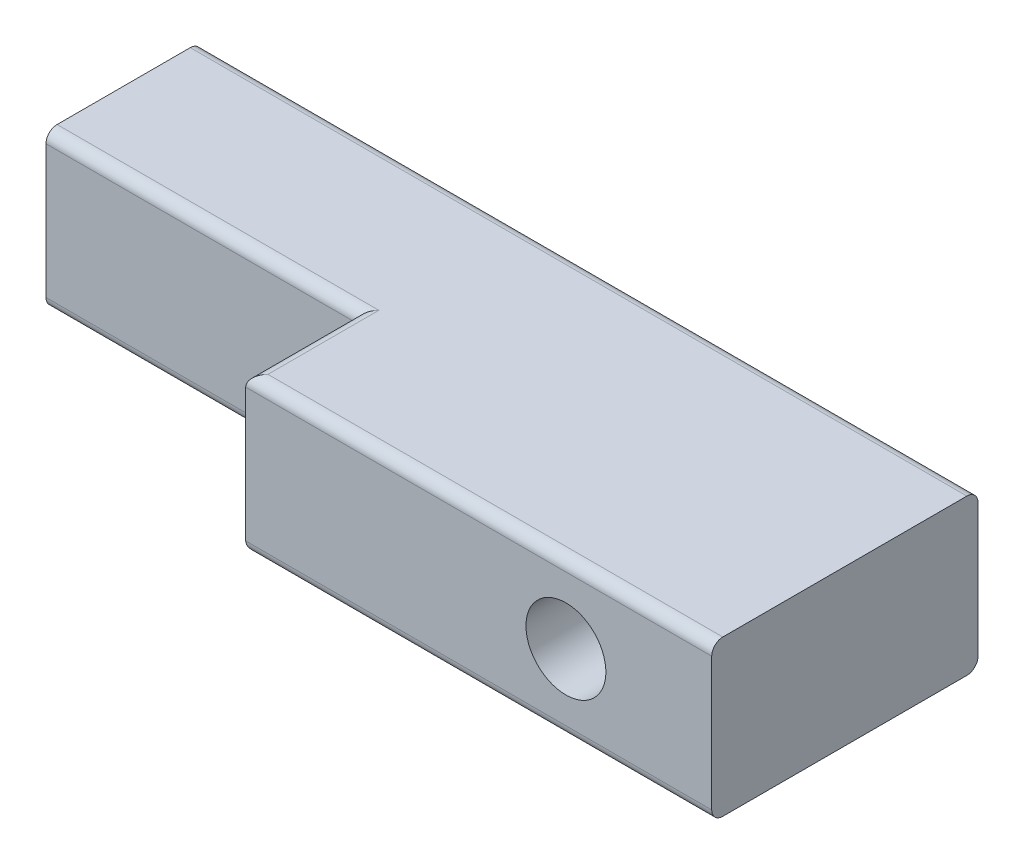
ISO-10303-21;
HEADER;
FILE_DESCRIPTION(('STEP AP214'),'2;1');
FILE_NAME('part.step','',(''),(''),'','','');
FILE_SCHEMA(('AUTOMOTIVE_DESIGN { 1 0 10303 214 1 1 1 1 }'));
ENDSEC;
DATA;
#1=APPLICATION_CONTEXT('core data for automotive mechanical design processes');
#2=APPLICATION_PROTOCOL_DEFINITION('international standard','automotive_design',2000,#1);
#3=PRODUCT_CONTEXT('',#1,'mechanical');
#4=PRODUCT('Part','Part','',(#3));
#5=PRODUCT_RELATED_PRODUCT_CATEGORY('part','',(#4));
#6=PRODUCT_DEFINITION_FORMATION('','',#4);
#7=PRODUCT_DEFINITION_CONTEXT('part definition',#1,'design');
#8=PRODUCT_DEFINITION('design','',#6,#7);
#9=PRODUCT_DEFINITION_SHAPE('','',#8);
#10=(LENGTH_UNIT() NAMED_UNIT(*) SI_UNIT(.MILLI.,.METRE.));
#11=(NAMED_UNIT(*) PLANE_ANGLE_UNIT() SI_UNIT($,.RADIAN.));
#12=(NAMED_UNIT(*) SI_UNIT($,.STERADIAN.) SOLID_ANGLE_UNIT());
#13=UNCERTAINTY_MEASURE_WITH_UNIT(LENGTH_MEASURE(1.E-05),#10,'distance_accuracy_value','');
#14=(GEOMETRIC_REPRESENTATION_CONTEXT(3) GLOBAL_UNCERTAINTY_ASSIGNED_CONTEXT((#13)) GLOBAL_UNIT_ASSIGNED_CONTEXT((#10,
#11,#12)) REPRESENTATION_CONTEXT('',''));
#15=CARTESIAN_POINT('',(0.,0.,0.));
#16=DIRECTION('',(0.,0.,1.));
#17=DIRECTION('',(1.,0.,0.));
#18=AXIS2_PLACEMENT_3D('',#15,#16,#17);
#19=CARTESIAN_POINT('',(0.,0.,7.));
#20=DIRECTION('',(0.,0.,-1.));
#21=DIRECTION('',(-1.,0.,0.));
#22=AXIS2_PLACEMENT_3D('',#19,#20,#21);
#23=PLANE('',#22);
#24=DIRECTION('',(0.,-1.,0.));
#25=VECTOR('',#24,1.);
#26=CARTESIAN_POINT('',(-17.5,-3.5,7.));
#27=LINE('',#26,#25);
#28=CARTESIAN_POINT('',(-17.5,3.,7.));
#29=VERTEX_POINT('',#28);
#30=CARTESIAN_POINT('',(-17.5,-3.,7.));
#31=VERTEX_POINT('',#30);
#32=EDGE_CURVE('E169',#29,#31,#27,.T.);
#33=ORIENTED_EDGE('',*,*,#32,.T.);
#34=DIRECTION('',(1.,0.,0.));
#35=VECTOR('',#34,1.);
#36=CARTESIAN_POINT('',(0.,-3.,7.));
#37=LINE('',#36,#35);
#38=CARTESIAN_POINT('',(-3.5,-3.,7.));
#39=VERTEX_POINT('',#38);
#40=EDGE_CURVE('E146',#31,#39,#37,.T.);
#41=ORIENTED_EDGE('',*,*,#40,.T.);
#42=DIRECTION('',(0.,-1.,0.));
#43=VECTOR('',#42,1.);
#44=CARTESIAN_POINT('',(-3.5,3.5,7.));
#45=LINE('',#44,#43);
#46=CARTESIAN_POINT('',(-3.5,3.,7.));
#47=VERTEX_POINT('',#46);
#48=EDGE_CURVE('E153',#47,#39,#45,.T.);
#49=ORIENTED_EDGE('',*,*,#48,.F.);
#50=DIRECTION('',(-1.,0.,0.));
#51=VECTOR('',#50,1.);
#52=CARTESIAN_POINT('',(0.,3.,7.));
#53=LINE('',#52,#51);
#54=EDGE_CURVE('E139',#47,#29,#53,.T.);
#55=ORIENTED_EDGE('',*,*,#54,.T.);
#56=EDGE_LOOP('',(#33,#41,#49,#55));
#57=FACE_BOUND('',#56,.T.);
#58=ADVANCED_FACE('F36',(#57),#23,.F.);
#59=CARTESIAN_POINT('',(17.5,-3.5,7.));
#60=DIRECTION('',(-1.,0.,0.));
#61=DIRECTION('',(0.,0.,1.));
#62=AXIS2_PLACEMENT_3D('',#59,#60,#61);
#63=PLANE('',#62);
#64=DIRECTION('',(0.,1.,0.));
#65=VECTOR('',#64,1.);
#66=CARTESIAN_POINT('',(17.5,3.5,12.));
#67=LINE('',#66,#65);
#68=CARTESIAN_POINT('',(17.5,-3.,12.));
#69=VERTEX_POINT('',#68);
#70=CARTESIAN_POINT('',(17.5,3.,12.));
#71=VERTEX_POINT('',#70);
#72=EDGE_CURVE('E162',#69,#71,#67,.T.);
#73=ORIENTED_EDGE('',*,*,#72,.F.);
#74=CARTESIAN_POINT('',(17.5,-3.,11.5));
#75=DIRECTION('',(-1.,0.,0.));
#76=DIRECTION('',(0.,0.,1.));
#77=AXIS2_PLACEMENT_3D('',#74,#75,#76);
#78=CIRCLE('',#77,0.5);
#79=CARTESIAN_POINT('',(17.5,-3.5,11.5));
#80=VERTEX_POINT('',#79);
#81=EDGE_CURVE('E221',#69,#80,#78,.F.);
#82=ORIENTED_EDGE('',*,*,#81,.T.);
#83=DIRECTION('',(0.,0.,-1.));
#84=VECTOR('',#83,1.);
#85=CARTESIAN_POINT('',(17.5,-3.5,7.));
#86=LINE('',#85,#84);
#87=CARTESIAN_POINT('',(17.5,-3.5,0.5));
#88=VERTEX_POINT('',#87);
#89=EDGE_CURVE('E171',#80,#88,#86,.T.);
#90=ORIENTED_EDGE('',*,*,#89,.T.);
#91=CARTESIAN_POINT('',(17.5,-3.,0.5));
#92=DIRECTION('',(-1.,0.,0.));
#93=DIRECTION('',(0.,0.,1.));
#94=AXIS2_PLACEMENT_3D('',#91,#92,#93);
#95=CIRCLE('',#94,0.5);
#96=CARTESIAN_POINT('',(17.5,-3.,0.));
#97=VERTEX_POINT('',#96);
#98=EDGE_CURVE('E59',#88,#97,#95,.F.);
#99=ORIENTED_EDGE('',*,*,#98,.T.);
#100=DIRECTION('',(0.,1.,0.));
#101=VECTOR('',#100,1.);
#102=CARTESIAN_POINT('',(17.5,-3.5,0.));
#103=LINE('',#102,#101);
#104=CARTESIAN_POINT('',(17.5,3.,0.));
#105=VERTEX_POINT('',#104);
#106=EDGE_CURVE('E173',#97,#105,#103,.T.);
#107=ORIENTED_EDGE('',*,*,#106,.T.);
#108=CARTESIAN_POINT('',(17.5,3.,0.5));
#109=DIRECTION('',(-1.,0.,0.));
#110=DIRECTION('',(0.,0.,1.));
#111=AXIS2_PLACEMENT_3D('',#108,#109,#110);
#112=CIRCLE('',#111,0.5);
#113=CARTESIAN_POINT('',(17.5,3.5,0.5));
#114=VERTEX_POINT('',#113);
#115=EDGE_CURVE('E216',#105,#114,#112,.F.);
#116=ORIENTED_EDGE('',*,*,#115,.T.);
#117=DIRECTION('',(0.,0.,-1.));
#118=VECTOR('',#117,1.);
#119=CARTESIAN_POINT('',(17.5,3.5,7.));
#120=LINE('',#119,#118);
#121=CARTESIAN_POINT('',(17.5,3.5,11.5));
#122=VERTEX_POINT('',#121);
#123=EDGE_CURVE('E184',#122,#114,#120,.T.);
#124=ORIENTED_EDGE('',*,*,#123,.F.);
#125=CARTESIAN_POINT('',(17.5,3.,11.5));
#126=DIRECTION('',(-1.,0.,0.));
#127=DIRECTION('',(0.,0.,1.));
#128=AXIS2_PLACEMENT_3D('',#125,#126,#127);
#129=CIRCLE('',#128,0.5);
#130=EDGE_CURVE('E219',#122,#71,#129,.F.);
#131=ORIENTED_EDGE('',*,*,#130,.T.);
#132=EDGE_LOOP('',(#73,#82,#90,#99,#107,#116,#124,#131));
#133=FACE_BOUND('',#132,.T.);
#134=ADVANCED_FACE('F266',(#133),#63,.F.);
#135=CARTESIAN_POINT('',(-17.5,3.5,7.));
#136=DIRECTION('',(0.,-1.,0.));
#137=DIRECTION('',(0.,0.,-1.));
#138=AXIS2_PLACEMENT_3D('',#135,#136,#137);
#139=PLANE('',#138);
#140=DIRECTION('',(0.,0.,-1.));
#141=VECTOR('',#140,1.);
#142=CARTESIAN_POINT('',(-17.5,3.5,7.));
#143=LINE('',#142,#141);
#144=CARTESIAN_POINT('',(-17.5,3.5,6.5));
#145=VERTEX_POINT('',#144);
#146=CARTESIAN_POINT('',(-17.5,3.5,0.5));
#147=VERTEX_POINT('',#146);
#148=EDGE_CURVE('E181',#145,#147,#143,.T.);
#149=ORIENTED_EDGE('',*,*,#148,.F.);
#150=DIRECTION('',(-1.,0.,0.));
#151=VECTOR('',#150,1.);
#152=CARTESIAN_POINT('',(-17.5,3.5,6.5));
#153=LINE('',#152,#151);
#154=CARTESIAN_POINT('',(-3.,3.5,6.5));
#155=VERTEX_POINT('',#154);
#156=EDGE_CURVE('E193',#145,#155,#153,.F.);
#157=ORIENTED_EDGE('',*,*,#156,.T.);
#158=DIRECTION('',(0.,0.,-1.));
#159=VECTOR('',#158,1.);
#160=CARTESIAN_POINT('',(-3.,3.5,7.));
#161=LINE('',#160,#159);
#162=CARTESIAN_POINT('',(-3.,3.5,11.5));
#163=VERTEX_POINT('',#162);
#164=EDGE_CURVE('E133',#155,#163,#161,.F.);
#165=ORIENTED_EDGE('',*,*,#164,.T.);
#166=DIRECTION('',(-1.,0.,0.));
#167=VECTOR('',#166,1.);
#168=CARTESIAN_POINT('',(-17.5,3.5,11.5));
#169=LINE('',#168,#167);
#170=EDGE_CURVE('E190',#163,#122,#169,.F.);
#171=ORIENTED_EDGE('',*,*,#170,.T.);
#172=ORIENTED_EDGE('',*,*,#123,.T.);
#173=DIRECTION('',(-1.,0.,0.));
#174=VECTOR('',#173,1.);
#175=CARTESIAN_POINT('',(-17.5,3.5,0.5));
#176=LINE('',#175,#174);
#177=EDGE_CURVE('E158',#114,#147,#176,.T.);
#178=ORIENTED_EDGE('',*,*,#177,.T.);
#179=EDGE_LOOP('',(#149,#157,#165,#171,#172,#178));
#180=FACE_BOUND('',#179,.T.);
#181=ADVANCED_FACE('F261',(#180),#139,.F.);
#182=CARTESIAN_POINT('',(-17.5,-3.5,7.));
#183=DIRECTION('',(1.,0.,0.));
#184=DIRECTION('',(0.,0.,-1.));
#185=AXIS2_PLACEMENT_3D('',#182,#183,#184);
#186=PLANE('',#185);
#187=DIRECTION('',(0.,0.,-1.));
#188=VECTOR('',#187,1.);
#189=CARTESIAN_POINT('',(-17.5,-3.5,7.));
#190=LINE('',#189,#188);
#191=CARTESIAN_POINT('',(-17.5,-3.5,6.5));
#192=VERTEX_POINT('',#191);
#193=CARTESIAN_POINT('',(-17.5,-3.5,0.5));
#194=VERTEX_POINT('',#193);
#195=EDGE_CURVE('E178',#192,#194,#190,.T.);
#196=ORIENTED_EDGE('',*,*,#195,.F.);
#197=CARTESIAN_POINT('',(-17.5,-3.,6.5));
#198=DIRECTION('',(1.,0.,0.));
#199=DIRECTION('',(0.,0.,-1.));
#200=AXIS2_PLACEMENT_3D('',#197,#198,#199);
#201=CIRCLE('',#200,0.5);
#202=EDGE_CURVE('E210',#192,#31,#201,.F.);
#203=ORIENTED_EDGE('',*,*,#202,.T.);
#204=ORIENTED_EDGE('',*,*,#32,.F.);
#205=CARTESIAN_POINT('',(-17.5,3.,6.5));
#206=DIRECTION('',(1.,0.,0.));
#207=DIRECTION('',(0.,0.,-1.));
#208=AXIS2_PLACEMENT_3D('',#205,#206,#207);
#209=CIRCLE('',#208,0.5);
#210=EDGE_CURVE('E141',#29,#145,#209,.F.);
#211=ORIENTED_EDGE('',*,*,#210,.T.);
#212=ORIENTED_EDGE('',*,*,#148,.T.);
#213=CARTESIAN_POINT('',(-17.5,3.,0.5));
#214=DIRECTION('',(1.,0.,0.));
#215=DIRECTION('',(0.,0.,-1.));
#216=AXIS2_PLACEMENT_3D('',#213,#214,#215);
#217=CIRCLE('',#216,0.5);
#218=CARTESIAN_POINT('',(-17.5,3.,0.));
#219=VERTEX_POINT('',#218);
#220=EDGE_CURVE('E205',#147,#219,#217,.F.);
#221=ORIENTED_EDGE('',*,*,#220,.T.);
#222=DIRECTION('',(0.,-1.,0.));
#223=VECTOR('',#222,1.);
#224=CARTESIAN_POINT('',(-17.5,-3.5,0.));
#225=LINE('',#224,#223);
#226=CARTESIAN_POINT('',(-17.5,-3.,0.));
#227=VERTEX_POINT('',#226);
#228=EDGE_CURVE('E172',#219,#227,#225,.T.);
#229=ORIENTED_EDGE('',*,*,#228,.T.);
#230=CARTESIAN_POINT('',(-17.5,-3.,0.5));
#231=DIRECTION('',(1.,0.,0.));
#232=DIRECTION('',(0.,0.,-1.));
#233=AXIS2_PLACEMENT_3D('',#230,#231,#232);
#234=CIRCLE('',#233,0.5);
#235=EDGE_CURVE('E207',#227,#194,#234,.F.);
#236=ORIENTED_EDGE('',*,*,#235,.T.);
#237=EDGE_LOOP('',(#196,#203,#204,#211,#212,#221,#229,#236));
#238=FACE_BOUND('',#237,.T.);
#239=ADVANCED_FACE('F253',(#238),#186,.F.);
#240=CARTESIAN_POINT('',(-17.5,-3.5,7.));
#241=DIRECTION('',(0.,1.,0.));
#242=DIRECTION('',(0.,0.,1.));
#243=AXIS2_PLACEMENT_3D('',#240,#241,#242);
#244=PLANE('',#243);
#245=DIRECTION('',(0.,0.,-1.));
#246=VECTOR('',#245,1.);
#247=CARTESIAN_POINT('',(-3.,-3.5,7.));
#248=LINE('',#247,#246);
#249=CARTESIAN_POINT('',(-3.,-3.5,11.5));
#250=VERTEX_POINT('',#249);
#251=CARTESIAN_POINT('',(-3.,-3.5,6.5));
#252=VERTEX_POINT('',#251);
#253=EDGE_CURVE('E200',#250,#252,#248,.T.);
#254=ORIENTED_EDGE('',*,*,#253,.T.);
#255=DIRECTION('',(1.,0.,0.));
#256=VECTOR('',#255,1.);
#257=CARTESIAN_POINT('',(-17.5,-3.5,6.5));
#258=LINE('',#257,#256);
#259=EDGE_CURVE('E147',#252,#192,#258,.F.);
#260=ORIENTED_EDGE('',*,*,#259,.T.);
#261=ORIENTED_EDGE('',*,*,#195,.T.);
#262=DIRECTION('',(1.,0.,0.));
#263=VECTOR('',#262,1.);
#264=CARTESIAN_POINT('',(17.5,-3.5,0.5));
#265=LINE('',#264,#263);
#266=EDGE_CURVE('E195',#194,#88,#265,.T.);
#267=ORIENTED_EDGE('',*,*,#266,.T.);
#268=ORIENTED_EDGE('',*,*,#89,.F.);
#269=DIRECTION('',(1.,0.,0.));
#270=VECTOR('',#269,1.);
#271=CARTESIAN_POINT('',(-17.5,-3.5,11.5));
#272=LINE('',#271,#270);
#273=EDGE_CURVE('E198',#80,#250,#272,.F.);
#274=ORIENTED_EDGE('',*,*,#273,.T.);
#275=EDGE_LOOP('',(#254,#260,#261,#267,#268,#274));
#276=FACE_BOUND('',#275,.T.);
#277=ADVANCED_FACE('F243',(#276),#244,.F.);
#278=CARTESIAN_POINT('',(0.,0.,0.));
#279=DIRECTION('',(0.,0.,-1.));
#280=DIRECTION('',(-1.,0.,0.));
#281=AXIS2_PLACEMENT_3D('',#278,#279,#280);
#282=PLANE('',#281);
#283=CARTESIAN_POINT('',(10.9295931048964,0.,0.));
#284=DIRECTION('',(0.,0.,-1.));
#285=DIRECTION('',(-1.,0.,0.));
#286=AXIS2_PLACEMENT_3D('',#283,#284,#285);
#287=CIRCLE('',#286,1.8);
#288=CARTESIAN_POINT('',(9.12959310489643,0.,0.));
#289=VERTEX_POINT('',#288);
#290=EDGE_CURVE('E231',#289,#289,#287,.T.);
#291=ORIENTED_EDGE('',*,*,#290,.F.);
#292=EDGE_LOOP('',(#291));
#293=FACE_BOUND('',#292,.T.);
#294=ORIENTED_EDGE('',*,*,#106,.F.);
#295=DIRECTION('',(1.,0.,0.));
#296=VECTOR('',#295,1.);
#297=CARTESIAN_POINT('',(-17.5,-3.,0.));
#298=LINE('',#297,#296);
#299=EDGE_CURVE('E11',#97,#227,#298,.F.);
#300=ORIENTED_EDGE('',*,*,#299,.T.);
#301=ORIENTED_EDGE('',*,*,#228,.F.);
#302=DIRECTION('',(-1.,0.,0.));
#303=VECTOR('',#302,1.);
#304=CARTESIAN_POINT('',(17.5,3.,0.));
#305=LINE('',#304,#303);
#306=EDGE_CURVE('E45',#219,#105,#305,.F.);
#307=ORIENTED_EDGE('',*,*,#306,.T.);
#308=EDGE_LOOP('',(#294,#300,#301,#307));
#309=FACE_BOUND('',#308,.T.);
#310=ADVANCED_FACE('F241',(#293,#309),#282,.T.);
#311=CARTESIAN_POINT('',(-3.5,3.5,12.));
#312=DIRECTION('',(1.,0.,0.));
#313=DIRECTION('',(0.,0.,-1.));
#314=AXIS2_PLACEMENT_3D('',#311,#312,#313);
#315=PLANE('',#314);
#316=DIRECTION('',(0.,-1.,0.));
#317=VECTOR('',#316,1.);
#318=CARTESIAN_POINT('',(-3.5,3.5,12.));
#319=LINE('',#318,#317);
#320=CARTESIAN_POINT('',(-3.5,3.,12.));
#321=VERTEX_POINT('',#320);
#322=CARTESIAN_POINT('',(-3.5,-3.,12.));
#323=VERTEX_POINT('',#322);
#324=EDGE_CURVE('E156',#321,#323,#319,.T.);
#325=ORIENTED_EDGE('',*,*,#324,.F.);
#326=DIRECTION('',(0.,0.,-1.));
#327=VECTOR('',#326,1.);
#328=CARTESIAN_POINT('',(-3.5,3.,12.));
#329=LINE('',#328,#327);
#330=EDGE_CURVE('E132',#321,#47,#329,.T.);
#331=ORIENTED_EDGE('',*,*,#330,.T.);
#332=ORIENTED_EDGE('',*,*,#48,.T.);
#333=DIRECTION('',(0.,0.,-1.));
#334=VECTOR('',#333,1.);
#335=CARTESIAN_POINT('',(-3.5,-3.,12.));
#336=LINE('',#335,#334);
#337=EDGE_CURVE('E159',#39,#323,#336,.F.);
#338=ORIENTED_EDGE('',*,*,#337,.T.);
#339=EDGE_LOOP('',(#325,#331,#332,#338));
#340=FACE_BOUND('',#339,.T.);
#341=ADVANCED_FACE('F152',(#340),#315,.F.);
#342=CARTESIAN_POINT('',(0.,0.,12.));
#343=DIRECTION('',(0.,0.,-1.));
#344=DIRECTION('',(-1.,0.,0.));
#345=AXIS2_PLACEMENT_3D('',#342,#343,#344);
#346=PLANE('',#345);
#347=CARTESIAN_POINT('',(10.9295931048964,0.,12.));
#348=DIRECTION('',(0.,0.,-1.));
#349=DIRECTION('',(-1.,0.,0.));
#350=AXIS2_PLACEMENT_3D('',#347,#348,#349);
#351=CIRCLE('',#350,1.8);
#352=CARTESIAN_POINT('',(9.12959310489643,0.,12.));
#353=VERTEX_POINT('',#352);
#354=EDGE_CURVE('E224',#353,#353,#351,.T.);
#355=ORIENTED_EDGE('',*,*,#354,.T.);
#356=EDGE_LOOP('',(#355));
#357=FACE_BOUND('',#356,.T.);
#358=ORIENTED_EDGE('',*,*,#324,.T.);
#359=DIRECTION('',(1.,0.,0.));
#360=VECTOR('',#359,1.);
#361=CARTESIAN_POINT('',(0.,-3.,12.));
#362=LINE('',#361,#360);
#363=EDGE_CURVE('E214',#323,#69,#362,.T.);
#364=ORIENTED_EDGE('',*,*,#363,.T.);
#365=ORIENTED_EDGE('',*,*,#72,.T.);
#366=DIRECTION('',(-1.,0.,0.));
#367=VECTOR('',#366,1.);
#368=CARTESIAN_POINT('',(0.,3.,12.));
#369=LINE('',#368,#367);
#370=EDGE_CURVE('E212',#71,#321,#369,.T.);
#371=ORIENTED_EDGE('',*,*,#370,.T.);
#372=EDGE_LOOP('',(#358,#364,#365,#371));
#373=FACE_BOUND('',#372,.T.);
#374=ADVANCED_FACE('F273',(#357,#373),#346,.F.);
#375=CARTESIAN_POINT('',(0.,3.,11.5));
#376=DIRECTION('',(-1.,0.,0.));
#377=DIRECTION('',(0.,0.,1.));
#378=AXIS2_PLACEMENT_3D('',#375,#376,#377);
#379=CYLINDRICAL_SURFACE('',#378,0.5);
#380=ORIENTED_EDGE('',*,*,#130,.F.);
#381=ORIENTED_EDGE('',*,*,#170,.F.);
#382=CARTESIAN_POINT('',(-3.,3.,11.5));
#383=DIRECTION('',(-0.707106781186547,0.,-0.707106781186547));
#384=DIRECTION('',(-0.707106781186547,0.,0.707106781186547));
#385=AXIS2_PLACEMENT_3D('',#382,#383,#384);
#386=ELLIPSE('',#385,0.707106781186547,0.5);
#387=EDGE_CURVE('E136',#321,#163,#386,.T.);
#388=ORIENTED_EDGE('',*,*,#387,.F.);
#389=ORIENTED_EDGE('',*,*,#370,.F.);
#390=EDGE_LOOP('',(#380,#381,#388,#389));
#391=FACE_BOUND('',#390,.T.);
#392=ADVANCED_FACE('F271',(#391),#379,.T.);
#393=CARTESIAN_POINT('',(0.,3.,6.5));
#394=DIRECTION('',(-1.,0.,0.));
#395=DIRECTION('',(0.,0.,1.));
#396=AXIS2_PLACEMENT_3D('',#393,#394,#395);
#397=CYLINDRICAL_SURFACE('',#396,0.5);
#398=ORIENTED_EDGE('',*,*,#210,.F.);
#399=ORIENTED_EDGE('',*,*,#54,.F.);
#400=CARTESIAN_POINT('',(-3.,3.,6.5));
#401=DIRECTION('',(-0.707106781186547,0.,-0.707106781186547));
#402=DIRECTION('',(0.707106781186547,0.,-0.707106781186547));
#403=AXIS2_PLACEMENT_3D('',#400,#401,#402);
#404=ELLIPSE('',#403,0.707106781186547,0.5);
#405=EDGE_CURVE('E127',#155,#47,#404,.F.);
#406=ORIENTED_EDGE('',*,*,#405,.F.);
#407=ORIENTED_EDGE('',*,*,#156,.F.);
#408=EDGE_LOOP('',(#398,#399,#406,#407));
#409=FACE_BOUND('',#408,.T.);
#410=ADVANCED_FACE('F140',(#409),#397,.T.);
#411=CARTESIAN_POINT('',(-3.,3.,12.));
#412=DIRECTION('',(0.,0.,-1.));
#413=DIRECTION('',(-1.,0.,0.));
#414=AXIS2_PLACEMENT_3D('',#411,#412,#413);
#415=CYLINDRICAL_SURFACE('',#414,0.5);
#416=ORIENTED_EDGE('',*,*,#387,.T.);
#417=ORIENTED_EDGE('',*,*,#164,.F.);
#418=ORIENTED_EDGE('',*,*,#405,.T.);
#419=ORIENTED_EDGE('',*,*,#330,.F.);
#420=EDGE_LOOP('',(#416,#417,#418,#419));
#421=FACE_BOUND('',#420,.T.);
#422=ADVANCED_FACE('F130',(#421),#415,.T.);
#423=CARTESIAN_POINT('',(0.,-3.,11.5));
#424=DIRECTION('',(1.,0.,0.));
#425=DIRECTION('',(0.,0.,-1.));
#426=AXIS2_PLACEMENT_3D('',#423,#424,#425);
#427=CYLINDRICAL_SURFACE('',#426,0.5);
#428=ORIENTED_EDGE('',*,*,#81,.F.);
#429=ORIENTED_EDGE('',*,*,#363,.F.);
#430=CARTESIAN_POINT('',(-3.,-3.,11.5));
#431=DIRECTION('',(0.707106781186547,0.,0.707106781186547));
#432=DIRECTION('',(0.707106781186547,0.,-0.707106781186547));
#433=AXIS2_PLACEMENT_3D('',#430,#431,#432);
#434=ELLIPSE('',#433,0.707106781186547,0.5);
#435=EDGE_CURVE('E40',#250,#323,#434,.F.);
#436=ORIENTED_EDGE('',*,*,#435,.F.);
#437=ORIENTED_EDGE('',*,*,#273,.F.);
#438=EDGE_LOOP('',(#428,#429,#436,#437));
#439=FACE_BOUND('',#438,.T.);
#440=ADVANCED_FACE('F278',(#439),#427,.T.);
#441=CARTESIAN_POINT('',(0.,-3.,6.5));
#442=DIRECTION('',(1.,0.,0.));
#443=DIRECTION('',(0.,0.,-1.));
#444=AXIS2_PLACEMENT_3D('',#441,#442,#443);
#445=CYLINDRICAL_SURFACE('',#444,0.5);
#446=ORIENTED_EDGE('',*,*,#202,.F.);
#447=ORIENTED_EDGE('',*,*,#259,.F.);
#448=CARTESIAN_POINT('',(-3.,-3.,6.5));
#449=DIRECTION('',(-0.707106781186547,0.,-0.707106781186547));
#450=DIRECTION('',(0.707106781186547,0.,-0.707106781186547));
#451=AXIS2_PLACEMENT_3D('',#448,#449,#450);
#452=ELLIPSE('',#451,0.707106781186547,0.5);
#453=EDGE_CURVE('E223',#39,#252,#452,.F.);
#454=ORIENTED_EDGE('',*,*,#453,.F.);
#455=ORIENTED_EDGE('',*,*,#40,.F.);
#456=EDGE_LOOP('',(#446,#447,#454,#455));
#457=FACE_BOUND('',#456,.T.);
#458=ADVANCED_FACE('F258',(#457),#445,.T.);
#459=CARTESIAN_POINT('',(-3.,-3.,7.));
#460=DIRECTION('',(0.,0.,-1.));
#461=DIRECTION('',(-1.,0.,0.));
#462=AXIS2_PLACEMENT_3D('',#459,#460,#461);
#463=CYLINDRICAL_SURFACE('',#462,0.5);
#464=ORIENTED_EDGE('',*,*,#435,.T.);
#465=ORIENTED_EDGE('',*,*,#337,.F.);
#466=ORIENTED_EDGE('',*,*,#453,.T.);
#467=ORIENTED_EDGE('',*,*,#253,.F.);
#468=EDGE_LOOP('',(#464,#465,#466,#467));
#469=FACE_BOUND('',#468,.T.);
#470=ADVANCED_FACE('F280',(#469),#463,.T.);
#471=CARTESIAN_POINT('',(-17.5,-3.,0.5));
#472=DIRECTION('',(-1.,0.,0.));
#473=DIRECTION('',(0.,0.,1.));
#474=AXIS2_PLACEMENT_3D('',#471,#472,#473);
#475=CYLINDRICAL_SURFACE('',#474,0.5);
#476=ORIENTED_EDGE('',*,*,#235,.F.);
#477=ORIENTED_EDGE('',*,*,#299,.F.);
#478=ORIENTED_EDGE('',*,*,#98,.F.);
#479=ORIENTED_EDGE('',*,*,#266,.F.);
#480=EDGE_LOOP('',(#476,#477,#478,#479));
#481=FACE_BOUND('',#480,.T.);
#482=ADVANCED_FACE('F249',(#481),#475,.T.);
#483=CARTESIAN_POINT('',(-17.5,3.,0.5));
#484=DIRECTION('',(1.,0.,0.));
#485=DIRECTION('',(0.,0.,-1.));
#486=AXIS2_PLACEMENT_3D('',#483,#484,#485);
#487=CYLINDRICAL_SURFACE('',#486,0.5);
#488=ORIENTED_EDGE('',*,*,#115,.F.);
#489=ORIENTED_EDGE('',*,*,#306,.F.);
#490=ORIENTED_EDGE('',*,*,#220,.F.);
#491=ORIENTED_EDGE('',*,*,#177,.F.);
#492=EDGE_LOOP('',(#488,#489,#490,#491));
#493=FACE_BOUND('',#492,.T.);
#494=ADVANCED_FACE('F38',(#493),#487,.T.);
#495=CARTESIAN_POINT('',(10.9295931048964,0.,0.));
#496=DIRECTION('',(0.,0.,-1.));
#497=DIRECTION('',(-1.,0.,0.));
#498=AXIS2_PLACEMENT_3D('',#495,#496,#497);
#499=CYLINDRICAL_SURFACE('',#498,1.8);
#500=ORIENTED_EDGE('',*,*,#354,.F.);
#501=EDGE_LOOP('',(#500));
#502=FACE_BOUND('',#501,.T.);
#503=ORIENTED_EDGE('',*,*,#290,.T.);
#504=EDGE_LOOP('',(#503));
#505=FACE_BOUND('',#504,.T.);
#506=ADVANCED_FACE('F239',(#502,#505),#499,.F.);
#507=CLOSED_SHELL('',(#58,#134,#181,#239,#277,#310,#341,#374,#392,#410,#422,#440,#458,#470,#482,
#494,#506));
#508=MANIFOLD_SOLID_BREP('B2',#507);
#509=ADVANCED_BREP_SHAPE_REPRESENTATION('',(#18,#508),#14);
#510=SHAPE_DEFINITION_REPRESENTATION(#9,#509);
ENDSEC;
END-ISO-10303-21;
